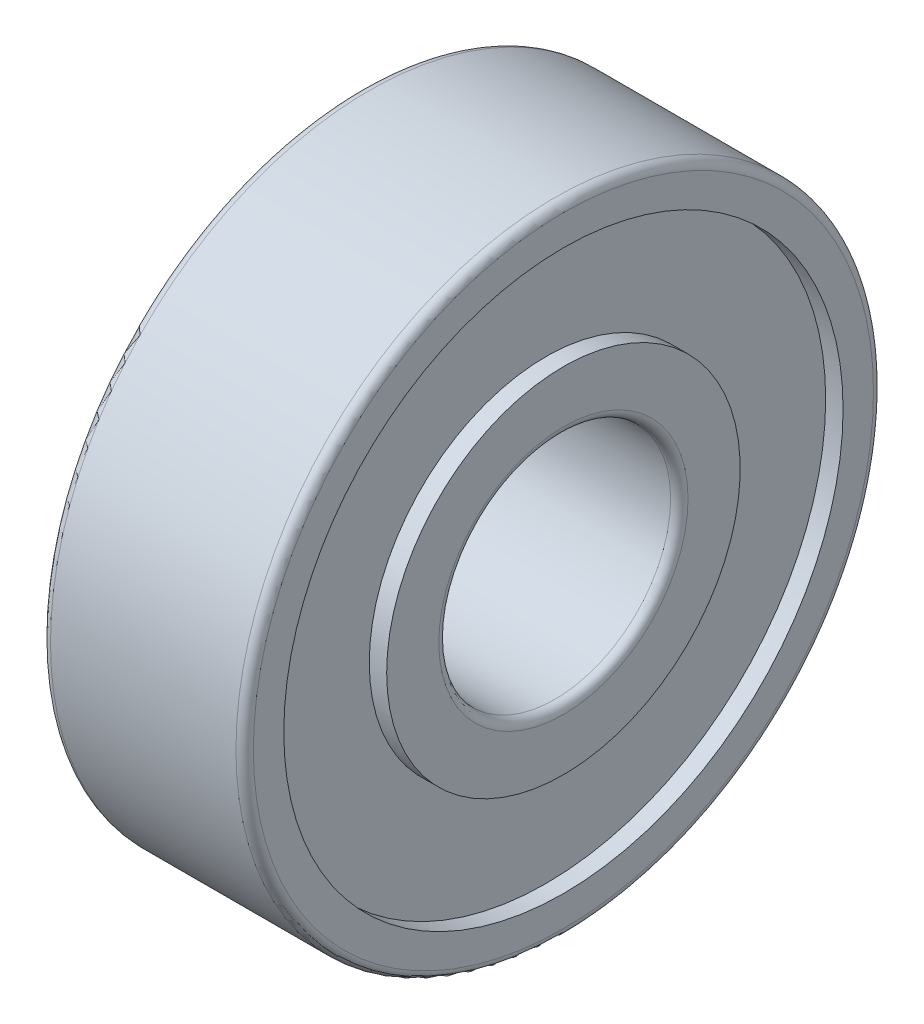
ISO-10303-21;
HEADER;
FILE_DESCRIPTION(('STEP AP214'),'2;1');
FILE_NAME('part.step','',(''),(''),'','','');
FILE_SCHEMA(('AUTOMOTIVE_DESIGN { 1 0 10303 214 1 1 1 1 }'));
ENDSEC;
DATA;
#1=APPLICATION_CONTEXT('core data for automotive mechanical design processes');
#2=APPLICATION_PROTOCOL_DEFINITION('international standard','automotive_design',2000,#1);
#3=PRODUCT_CONTEXT('',#1,'mechanical');
#4=PRODUCT('Part','Part','',(#3));
#5=PRODUCT_RELATED_PRODUCT_CATEGORY('part','',(#4));
#6=PRODUCT_DEFINITION_FORMATION('','',#4);
#7=PRODUCT_DEFINITION_CONTEXT('part definition',#1,'design');
#8=PRODUCT_DEFINITION('design','',#6,#7);
#9=PRODUCT_DEFINITION_SHAPE('','',#8);
#10=(LENGTH_UNIT() NAMED_UNIT(*) SI_UNIT(.MILLI.,.METRE.));
#11=(NAMED_UNIT(*) PLANE_ANGLE_UNIT() SI_UNIT($,.RADIAN.));
#12=(NAMED_UNIT(*) SI_UNIT($,.STERADIAN.) SOLID_ANGLE_UNIT());
#13=UNCERTAINTY_MEASURE_WITH_UNIT(LENGTH_MEASURE(1.E-05),#10,'distance_accuracy_value','');
#14=(GEOMETRIC_REPRESENTATION_CONTEXT(3) GLOBAL_UNCERTAINTY_ASSIGNED_CONTEXT((#13)) GLOBAL_UNIT_ASSIGNED_CONTEXT((#10,
#11,#12)) REPRESENTATION_CONTEXT('',''));
#15=CARTESIAN_POINT('',(0.,0.,0.));
#16=DIRECTION('',(0.,0.,1.));
#17=DIRECTION('',(1.,0.,0.));
#18=AXIS2_PLACEMENT_3D('',#15,#16,#17);
#19=CARTESIAN_POINT('',(-7.,11.,0.));
#20=DIRECTION('',(1.,0.,0.));
#21=DIRECTION('',(0.,0.,-1.));
#22=AXIS2_PLACEMENT_3D('',#19,#20,#21);
#23=PLANE('',#22);
#24=CARTESIAN_POINT('',(-7.,0.,0.));
#25=DIRECTION('',(1.,0.,0.));
#26=DIRECTION('',(0.,0.,-1.));
#27=AXIS2_PLACEMENT_3D('',#24,#25,#26);
#28=CIRCLE('',#27,10.7);
#29=CARTESIAN_POINT('',(-7.,0.,-10.7));
#30=VERTEX_POINT('',#29);
#31=EDGE_CURVE('E55',#30,#30,#28,.F.);
#32=ORIENTED_EDGE('',*,*,#31,.T.);
#33=EDGE_LOOP('',(#32));
#34=FACE_BOUND('',#33,.T.);
#35=CARTESIAN_POINT('',(-7.,0.,0.));
#36=DIRECTION('',(-1.,0.,0.));
#37=DIRECTION('',(0.,0.,1.));
#38=AXIS2_PLACEMENT_3D('',#35,#36,#37);
#39=CIRCLE('',#38,9.65);
#40=CARTESIAN_POINT('',(-7.,0.,9.65));
#41=VERTEX_POINT('',#40);
#42=EDGE_CURVE('E67',#41,#41,#39,.T.);
#43=ORIENTED_EDGE('',*,*,#42,.F.);
#44=EDGE_LOOP('',(#43));
#45=FACE_BOUND('',#44,.T.);
#46=ADVANCED_FACE('F35',(#34,#45),#23,.F.);
#47=CARTESIAN_POINT('',(-7.,0.,0.));
#48=DIRECTION('',(-1.,0.,0.));
#49=DIRECTION('',(0.,0.,1.));
#50=AXIS2_PLACEMENT_3D('',#47,#48,#49);
#51=CYLINDRICAL_SURFACE('',#50,9.65);
#52=CARTESIAN_POINT('',(-6.4,0.,0.));
#53=DIRECTION('',(-1.,0.,0.));
#54=DIRECTION('',(0.,0.,1.));
#55=AXIS2_PLACEMENT_3D('',#52,#53,#54);
#56=CIRCLE('',#55,9.65);
#57=CARTESIAN_POINT('',(-6.4,0.,9.65));
#58=VERTEX_POINT('',#57);
#59=EDGE_CURVE('E70',#58,#58,#56,.T.);
#60=ORIENTED_EDGE('',*,*,#59,.F.);
#61=EDGE_LOOP('',(#60));
#62=FACE_BOUND('',#61,.T.);
#63=ORIENTED_EDGE('',*,*,#42,.T.);
#64=EDGE_LOOP('',(#63));
#65=FACE_BOUND('',#64,.T.);
#66=ADVANCED_FACE('F123',(#62,#65),#51,.F.);
#67=CARTESIAN_POINT('',(-6.4,9.65,0.));
#68=DIRECTION('',(1.,0.,0.));
#69=DIRECTION('',(0.,0.,-1.));
#70=AXIS2_PLACEMENT_3D('',#67,#68,#69);
#71=PLANE('',#70);
#72=CARTESIAN_POINT('',(-6.4,0.,0.));
#73=DIRECTION('',(-1.,0.,0.));
#74=DIRECTION('',(0.,0.,1.));
#75=AXIS2_PLACEMENT_3D('',#72,#73,#74);
#76=CIRCLE('',#75,6.1);
#77=CARTESIAN_POINT('',(-6.4,0.,6.1));
#78=VERTEX_POINT('',#77);
#79=EDGE_CURVE('E73',#78,#78,#76,.T.);
#80=ORIENTED_EDGE('',*,*,#79,.F.);
#81=EDGE_LOOP('',(#80));
#82=FACE_BOUND('',#81,.T.);
#83=ORIENTED_EDGE('',*,*,#59,.T.);
#84=EDGE_LOOP('',(#83));
#85=FACE_BOUND('',#84,.T.);
#86=ADVANCED_FACE('F129',(#82,#85),#71,.F.);
#87=CARTESIAN_POINT('',(-7.,0.,0.));
#88=DIRECTION('',(-1.,0.,0.));
#89=DIRECTION('',(0.,0.,1.));
#90=AXIS2_PLACEMENT_3D('',#87,#88,#89);
#91=CYLINDRICAL_SURFACE('',#90,6.1);
#92=CARTESIAN_POINT('',(-7.,0.,0.));
#93=DIRECTION('',(-1.,0.,0.));
#94=DIRECTION('',(0.,0.,1.));
#95=AXIS2_PLACEMENT_3D('',#92,#93,#94);
#96=CIRCLE('',#95,6.1);
#97=CARTESIAN_POINT('',(-7.,0.,6.1));
#98=VERTEX_POINT('',#97);
#99=EDGE_CURVE('E76',#98,#98,#96,.T.);
#100=ORIENTED_EDGE('',*,*,#99,.F.);
#101=EDGE_LOOP('',(#100));
#102=FACE_BOUND('',#101,.T.);
#103=ORIENTED_EDGE('',*,*,#79,.T.);
#104=EDGE_LOOP('',(#103));
#105=FACE_BOUND('',#104,.T.);
#106=ADVANCED_FACE('F186',(#102,#105),#91,.T.);
#107=CARTESIAN_POINT('',(-7.,6.1,0.));
#108=DIRECTION('',(1.,0.,0.));
#109=DIRECTION('',(0.,0.,-1.));
#110=AXIS2_PLACEMENT_3D('',#107,#108,#109);
#111=PLANE('',#110);
#112=CARTESIAN_POINT('',(-7.,0.,0.));
#113=DIRECTION('',(1.,0.,0.));
#114=DIRECTION('',(0.,0.,-1.));
#115=AXIS2_PLACEMENT_3D('',#112,#113,#114);
#116=CIRCLE('',#115,4.3);
#117=CARTESIAN_POINT('',(-7.,0.,-4.3));
#118=VERTEX_POINT('',#117);
#119=EDGE_CURVE('E10',#118,#118,#116,.T.);
#120=ORIENTED_EDGE('',*,*,#119,.T.);
#121=EDGE_LOOP('',(#120));
#122=FACE_BOUND('',#121,.T.);
#123=ORIENTED_EDGE('',*,*,#99,.T.);
#124=EDGE_LOOP('',(#123));
#125=FACE_BOUND('',#124,.T.);
#126=ADVANCED_FACE('F120',(#122,#125),#111,.F.);
#127=CARTESIAN_POINT('',(-7.,0.,0.));
#128=DIRECTION('',(-1.,0.,0.));
#129=DIRECTION('',(0.,0.,1.));
#130=AXIS2_PLACEMENT_3D('',#127,#128,#129);
#131=CYLINDRICAL_SURFACE('',#130,4.);
#132=CARTESIAN_POINT('',(-0.3,0.,0.));
#133=DIRECTION('',(-1.,0.,0.));
#134=DIRECTION('',(0.,0.,1.));
#135=AXIS2_PLACEMENT_3D('',#132,#133,#134);
#136=CIRCLE('',#135,4.);
#137=CARTESIAN_POINT('',(-0.3,0.,4.));
#138=VERTEX_POINT('',#137);
#139=EDGE_CURVE('E42',#138,#138,#136,.F.);
#140=ORIENTED_EDGE('',*,*,#139,.T.);
#141=EDGE_LOOP('',(#140));
#142=FACE_BOUND('',#141,.T.);
#143=CARTESIAN_POINT('',(-6.7,0.,0.));
#144=DIRECTION('',(1.,0.,0.));
#145=DIRECTION('',(0.,0.,-1.));
#146=AXIS2_PLACEMENT_3D('',#143,#144,#145);
#147=CIRCLE('',#146,4.);
#148=CARTESIAN_POINT('',(-6.7,0.,-4.));
#149=VERTEX_POINT('',#148);
#150=EDGE_CURVE('E46',#149,#149,#147,.F.);
#151=ORIENTED_EDGE('',*,*,#150,.T.);
#152=EDGE_LOOP('',(#151));
#153=FACE_BOUND('',#152,.T.);
#154=ADVANCED_FACE('F114',(#142,#153),#131,.F.);
#155=CARTESIAN_POINT('',(0.,6.1,0.));
#156=DIRECTION('',(-1.,0.,0.));
#157=DIRECTION('',(0.,0.,1.));
#158=AXIS2_PLACEMENT_3D('',#155,#156,#157);
#159=PLANE('',#158);
#160=CARTESIAN_POINT('',(0.,0.,0.));
#161=DIRECTION('',(-1.,0.,0.));
#162=DIRECTION('',(0.,0.,1.));
#163=AXIS2_PLACEMENT_3D('',#160,#161,#162);
#164=CIRCLE('',#163,4.3);
#165=CARTESIAN_POINT('',(0.,0.,4.3));
#166=VERTEX_POINT('',#165);
#167=EDGE_CURVE('E50',#166,#166,#164,.T.);
#168=ORIENTED_EDGE('',*,*,#167,.T.);
#169=EDGE_LOOP('',(#168));
#170=FACE_BOUND('',#169,.T.);
#171=CARTESIAN_POINT('',(0.,0.,0.));
#172=DIRECTION('',(-1.,0.,0.));
#173=DIRECTION('',(0.,0.,1.));
#174=AXIS2_PLACEMENT_3D('',#171,#172,#173);
#175=CIRCLE('',#174,6.1);
#176=CARTESIAN_POINT('',(0.,0.,6.1));
#177=VERTEX_POINT('',#176);
#178=EDGE_CURVE('E79',#177,#177,#175,.T.);
#179=ORIENTED_EDGE('',*,*,#178,.F.);
#180=EDGE_LOOP('',(#179));
#181=FACE_BOUND('',#180,.T.);
#182=ADVANCED_FACE('F109',(#170,#181),#159,.F.);
#183=CARTESIAN_POINT('',(-7.,0.,0.));
#184=DIRECTION('',(-1.,0.,0.));
#185=DIRECTION('',(0.,0.,1.));
#186=AXIS2_PLACEMENT_3D('',#183,#184,#185);
#187=CYLINDRICAL_SURFACE('',#186,6.1);
#188=CARTESIAN_POINT('',(-0.600000000000001,0.,0.));
#189=DIRECTION('',(-1.,0.,0.));
#190=DIRECTION('',(0.,0.,1.));
#191=AXIS2_PLACEMENT_3D('',#188,#189,#190);
#192=CIRCLE('',#191,6.1);
#193=CARTESIAN_POINT('',(-0.600000000000001,0.,6.1));
#194=VERTEX_POINT('',#193);
#195=EDGE_CURVE('E82',#194,#194,#192,.T.);
#196=ORIENTED_EDGE('',*,*,#195,.F.);
#197=EDGE_LOOP('',(#196));
#198=FACE_BOUND('',#197,.T.);
#199=ORIENTED_EDGE('',*,*,#178,.T.);
#200=EDGE_LOOP('',(#199));
#201=FACE_BOUND('',#200,.T.);
#202=ADVANCED_FACE('F103',(#198,#201),#187,.T.);
#203=CARTESIAN_POINT('',(-0.600000000000001,9.65,0.));
#204=DIRECTION('',(-1.,0.,0.));
#205=DIRECTION('',(0.,0.,1.));
#206=AXIS2_PLACEMENT_3D('',#203,#204,#205);
#207=PLANE('',#206);
#208=CARTESIAN_POINT('',(-0.600000000000001,0.,0.));
#209=DIRECTION('',(-1.,0.,0.));
#210=DIRECTION('',(0.,0.,1.));
#211=AXIS2_PLACEMENT_3D('',#208,#209,#210);
#212=CIRCLE('',#211,9.65);
#213=CARTESIAN_POINT('',(-0.600000000000001,0.,9.65));
#214=VERTEX_POINT('',#213);
#215=EDGE_CURVE('E85',#214,#214,#212,.T.);
#216=ORIENTED_EDGE('',*,*,#215,.F.);
#217=EDGE_LOOP('',(#216));
#218=FACE_BOUND('',#217,.T.);
#219=ORIENTED_EDGE('',*,*,#195,.T.);
#220=EDGE_LOOP('',(#219));
#221=FACE_BOUND('',#220,.T.);
#222=ADVANCED_FACE('F97',(#218,#221),#207,.F.);
#223=CARTESIAN_POINT('',(-7.,0.,0.));
#224=DIRECTION('',(-1.,0.,0.));
#225=DIRECTION('',(0.,0.,1.));
#226=AXIS2_PLACEMENT_3D('',#223,#224,#225);
#227=CYLINDRICAL_SURFACE('',#226,9.65);
#228=CARTESIAN_POINT('',(0.,0.,0.));
#229=DIRECTION('',(-1.,0.,0.));
#230=DIRECTION('',(0.,0.,1.));
#231=AXIS2_PLACEMENT_3D('',#228,#229,#230);
#232=CIRCLE('',#231,9.65);
#233=CARTESIAN_POINT('',(0.,0.,9.65));
#234=VERTEX_POINT('',#233);
#235=EDGE_CURVE('E88',#234,#234,#232,.T.);
#236=ORIENTED_EDGE('',*,*,#235,.F.);
#237=EDGE_LOOP('',(#236));
#238=FACE_BOUND('',#237,.T.);
#239=ORIENTED_EDGE('',*,*,#215,.T.);
#240=EDGE_LOOP('',(#239));
#241=FACE_BOUND('',#240,.T.);
#242=ADVANCED_FACE('F94',(#238,#241),#227,.F.);
#243=CARTESIAN_POINT('',(0.,11.,0.));
#244=DIRECTION('',(-1.,0.,0.));
#245=DIRECTION('',(0.,0.,1.));
#246=AXIS2_PLACEMENT_3D('',#243,#244,#245);
#247=PLANE('',#246);
#248=CARTESIAN_POINT('',(0.,0.,0.));
#249=DIRECTION('',(-1.,0.,0.));
#250=DIRECTION('',(0.,0.,1.));
#251=AXIS2_PLACEMENT_3D('',#248,#249,#250);
#252=CIRCLE('',#251,10.7);
#253=CARTESIAN_POINT('',(0.,0.,10.7));
#254=VERTEX_POINT('',#253);
#255=EDGE_CURVE('E58',#254,#254,#252,.F.);
#256=ORIENTED_EDGE('',*,*,#255,.T.);
#257=EDGE_LOOP('',(#256));
#258=FACE_BOUND('',#257,.T.);
#259=ORIENTED_EDGE('',*,*,#235,.T.);
#260=EDGE_LOOP('',(#259));
#261=FACE_BOUND('',#260,.T.);
#262=ADVANCED_FACE('F92',(#258,#261),#247,.F.);
#263=CARTESIAN_POINT('',(-7.,0.,0.));
#264=DIRECTION('',(-1.,0.,0.));
#265=DIRECTION('',(0.,0.,1.));
#266=AXIS2_PLACEMENT_3D('',#263,#264,#265);
#267=CYLINDRICAL_SURFACE('',#266,11.);
#268=CARTESIAN_POINT('',(-0.3,0.,0.));
#269=DIRECTION('',(-1.,0.,0.));
#270=DIRECTION('',(0.,0.,1.));
#271=AXIS2_PLACEMENT_3D('',#268,#269,#270);
#272=CIRCLE('',#271,11.);
#273=CARTESIAN_POINT('',(-0.3,0.,11.));
#274=VERTEX_POINT('',#273);
#275=EDGE_CURVE('E61',#274,#274,#272,.T.);
#276=ORIENTED_EDGE('',*,*,#275,.T.);
#277=EDGE_LOOP('',(#276));
#278=FACE_BOUND('',#277,.T.);
#279=CARTESIAN_POINT('',(-6.7,0.,0.));
#280=DIRECTION('',(1.,0.,0.));
#281=DIRECTION('',(0.,0.,-1.));
#282=AXIS2_PLACEMENT_3D('',#279,#280,#281);
#283=CIRCLE('',#282,11.);
#284=CARTESIAN_POINT('',(-6.7,0.,-11.));
#285=VERTEX_POINT('',#284);
#286=EDGE_CURVE('E64',#285,#285,#283,.T.);
#287=ORIENTED_EDGE('',*,*,#286,.T.);
#288=EDGE_LOOP('',(#287));
#289=FACE_BOUND('',#288,.T.);
#290=ADVANCED_FACE('F139',(#278,#289),#267,.T.);
#291=CARTESIAN_POINT('',(-0.3,0.,0.));
#292=DIRECTION('',(-1.,0.,0.));
#293=DIRECTION('',(0.,0.,1.));
#294=AXIS2_PLACEMENT_3D('',#291,#292,#293);
#295=TOROIDAL_SURFACE('',#294,10.7,0.3);
#296=ORIENTED_EDGE('',*,*,#255,.F.);
#297=EDGE_LOOP('',(#296));
#298=FACE_BOUND('',#297,.T.);
#299=ORIENTED_EDGE('',*,*,#275,.F.);
#300=EDGE_LOOP('',(#299));
#301=FACE_BOUND('',#300,.T.);
#302=ADVANCED_FACE('F135',(#298,#301),#295,.T.);
#303=CARTESIAN_POINT('',(-6.7,0.,0.));
#304=DIRECTION('',(1.,0.,0.));
#305=DIRECTION('',(0.,0.,-1.));
#306=AXIS2_PLACEMENT_3D('',#303,#304,#305);
#307=TOROIDAL_SURFACE('',#306,10.7,0.3);
#308=ORIENTED_EDGE('',*,*,#286,.F.);
#309=EDGE_LOOP('',(#308));
#310=FACE_BOUND('',#309,.T.);
#311=ORIENTED_EDGE('',*,*,#31,.F.);
#312=EDGE_LOOP('',(#311));
#313=FACE_BOUND('',#312,.T.);
#314=ADVANCED_FACE('F138',(#310,#313),#307,.T.);
#315=CARTESIAN_POINT('',(-0.3,0.,0.));
#316=DIRECTION('',(-1.,0.,0.));
#317=DIRECTION('',(0.,0.,1.));
#318=AXIS2_PLACEMENT_3D('',#315,#316,#317);
#319=TOROIDAL_SURFACE('',#318,4.3,0.3);
#320=ORIENTED_EDGE('',*,*,#139,.F.);
#321=EDGE_LOOP('',(#320));
#322=FACE_BOUND('',#321,.T.);
#323=ORIENTED_EDGE('',*,*,#167,.F.);
#324=EDGE_LOOP('',(#323));
#325=FACE_BOUND('',#324,.T.);
#326=ADVANCED_FACE('F142',(#322,#325),#319,.T.);
#327=CARTESIAN_POINT('',(-6.7,0.,0.));
#328=DIRECTION('',(1.,0.,0.));
#329=DIRECTION('',(0.,0.,-1.));
#330=AXIS2_PLACEMENT_3D('',#327,#328,#329);
#331=TOROIDAL_SURFACE('',#330,4.3,0.3);
#332=ORIENTED_EDGE('',*,*,#119,.F.);
#333=EDGE_LOOP('',(#332));
#334=FACE_BOUND('',#333,.T.);
#335=ORIENTED_EDGE('',*,*,#150,.F.);
#336=EDGE_LOOP('',(#335));
#337=FACE_BOUND('',#336,.T.);
#338=ADVANCED_FACE('F37',(#334,#337),#331,.T.);
#339=CLOSED_SHELL('',(#46,#66,#86,#106,#126,#154,#182,#202,#222,#242,#262,#290,#302,#314,#326,#338));
#340=MANIFOLD_SOLID_BREP('B2',#339);
#341=ADVANCED_BREP_SHAPE_REPRESENTATION('',(#18,#340),#14);
#342=SHAPE_DEFINITION_REPRESENTATION(#9,#341);
ENDSEC;
END-ISO-10303-21;
